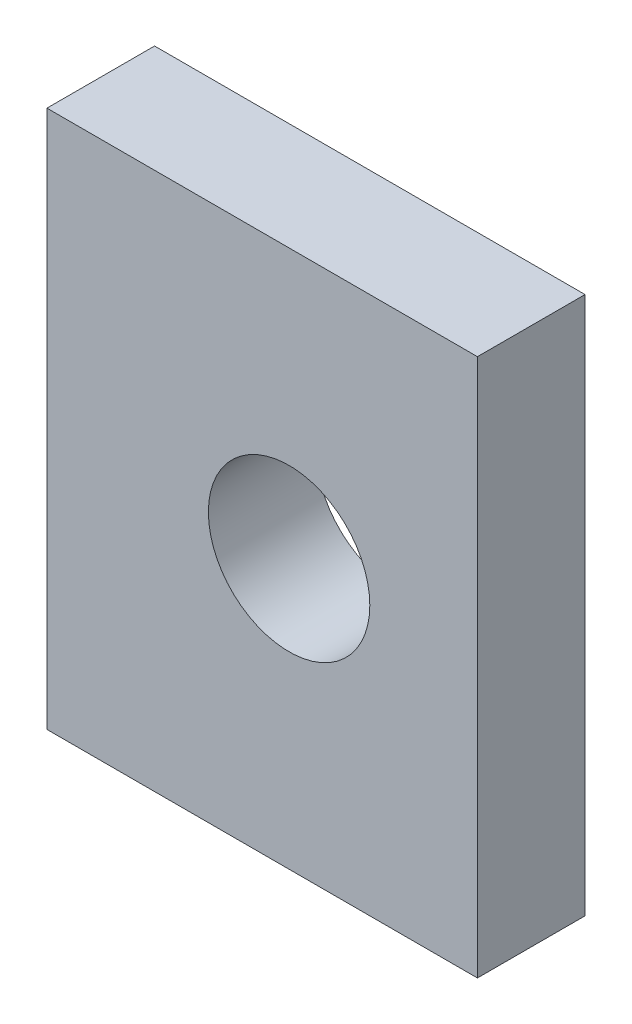
ISO-10303-21;
HEADER;
FILE_DESCRIPTION(('STEP AP214'),'2;1');
FILE_NAME('part.step','',(''),(''),'','','');
FILE_SCHEMA(('AUTOMOTIVE_DESIGN { 1 0 10303 214 1 1 1 1 }'));
ENDSEC;
DATA;
#1=APPLICATION_CONTEXT('core data for automotive mechanical design processes');
#2=APPLICATION_PROTOCOL_DEFINITION('international standard','automotive_design',2000,#1);
#3=PRODUCT_CONTEXT('',#1,'mechanical');
#4=PRODUCT('Part','Part','',(#3));
#5=PRODUCT_RELATED_PRODUCT_CATEGORY('part','',(#4));
#6=PRODUCT_DEFINITION_FORMATION('','',#4);
#7=PRODUCT_DEFINITION_CONTEXT('part definition',#1,'design');
#8=PRODUCT_DEFINITION('design','',#6,#7);
#9=PRODUCT_DEFINITION_SHAPE('','',#8);
#10=(LENGTH_UNIT() NAMED_UNIT(*) SI_UNIT(.MILLI.,.METRE.));
#11=(NAMED_UNIT(*) PLANE_ANGLE_UNIT() SI_UNIT($,.RADIAN.));
#12=(NAMED_UNIT(*) SI_UNIT($,.STERADIAN.) SOLID_ANGLE_UNIT());
#13=UNCERTAINTY_MEASURE_WITH_UNIT(LENGTH_MEASURE(1.E-05),#10,'distance_accuracy_value','');
#14=(GEOMETRIC_REPRESENTATION_CONTEXT(3) GLOBAL_UNCERTAINTY_ASSIGNED_CONTEXT((#13)) GLOBAL_UNIT_ASSIGNED_CONTEXT((#10,
#11,#12)) REPRESENTATION_CONTEXT('',''));
#15=CARTESIAN_POINT('',(0.,0.,0.));
#16=DIRECTION('',(0.,0.,1.));
#17=DIRECTION('',(1.,0.,0.));
#18=AXIS2_PLACEMENT_3D('',#15,#16,#17);
#19=CARTESIAN_POINT('',(0.,0.,2.));
#20=DIRECTION('',(0.,0.,-1.));
#21=DIRECTION('',(-1.,0.,0.));
#22=AXIS2_PLACEMENT_3D('',#19,#20,#21);
#23=PLANE('',#22);
#24=DIRECTION('',(0.,1.,0.));
#25=VECTOR('',#24,1.);
#26=CARTESIAN_POINT('',(7.99999999999996,10.,2.));
#27=LINE('',#26,#25);
#28=CARTESIAN_POINT('',(7.99999999999996,0.,2.));
#29=VERTEX_POINT('',#28);
#30=CARTESIAN_POINT('',(7.99999999999996,10.,2.));
#31=VERTEX_POINT('',#30);
#32=EDGE_CURVE('E85',#29,#31,#27,.T.);
#33=ORIENTED_EDGE('',*,*,#32,.T.);
#34=DIRECTION('',(-1.,0.,0.));
#35=VECTOR('',#34,1.);
#36=CARTESIAN_POINT('',(0.,10.,2.));
#37=LINE('',#36,#35);
#38=CARTESIAN_POINT('',(0.,10.,2.));
#39=VERTEX_POINT('',#38);
#40=EDGE_CURVE('E80',#31,#39,#37,.T.);
#41=ORIENTED_EDGE('',*,*,#40,.T.);
#42=DIRECTION('',(0.,-1.,0.));
#43=VECTOR('',#42,1.);
#44=CARTESIAN_POINT('',(0.,10.,2.));
#45=LINE('',#44,#43);
#46=CARTESIAN_POINT('',(0.,0.,2.));
#47=VERTEX_POINT('',#46);
#48=EDGE_CURVE('E83',#39,#47,#45,.T.);
#49=ORIENTED_EDGE('',*,*,#48,.T.);
#50=DIRECTION('',(1.,0.,0.));
#51=VECTOR('',#50,1.);
#52=CARTESIAN_POINT('',(7.99999999999996,0.,2.));
#53=LINE('',#52,#51);
#54=EDGE_CURVE('E50',#47,#29,#53,.T.);
#55=ORIENTED_EDGE('',*,*,#54,.T.);
#56=EDGE_LOOP('',(#33,#41,#49,#55));
#57=FACE_BOUND('',#56,.T.);
#58=CARTESIAN_POINT('',(4.49999999999998,5.,2.));
#59=DIRECTION('',(0.,0.,1.));
#60=DIRECTION('',(1.,0.,0.));
#61=AXIS2_PLACEMENT_3D('',#58,#59,#60);
#62=CIRCLE('',#61,1.5);
#63=CARTESIAN_POINT('',(5.99999999999998,5.,2.));
#64=VERTEX_POINT('',#63);
#65=EDGE_CURVE('E100',#64,#64,#62,.T.);
#66=ORIENTED_EDGE('',*,*,#65,.F.);
#67=EDGE_LOOP('',(#66));
#68=FACE_BOUND('',#67,.T.);
#69=ADVANCED_FACE('F33',(#57,#68),#23,.F.);
#70=CARTESIAN_POINT('',(0.,0.,0.));
#71=DIRECTION('',(0.,0.,-1.));
#72=DIRECTION('',(-1.,0.,0.));
#73=AXIS2_PLACEMENT_3D('',#70,#71,#72);
#74=PLANE('',#73);
#75=DIRECTION('',(0.,1.,0.));
#76=VECTOR('',#75,1.);
#77=CARTESIAN_POINT('',(7.99999999999996,10.,0.));
#78=LINE('',#77,#76);
#79=CARTESIAN_POINT('',(7.99999999999996,0.,0.));
#80=VERTEX_POINT('',#79);
#81=CARTESIAN_POINT('',(7.99999999999996,10.,0.));
#82=VERTEX_POINT('',#81);
#83=EDGE_CURVE('E97',#80,#82,#78,.T.);
#84=ORIENTED_EDGE('',*,*,#83,.F.);
#85=DIRECTION('',(1.,0.,0.));
#86=VECTOR('',#85,1.);
#87=CARTESIAN_POINT('',(7.99999999999996,0.,0.));
#88=LINE('',#87,#86);
#89=CARTESIAN_POINT('',(0.,0.,0.));
#90=VERTEX_POINT('',#89);
#91=EDGE_CURVE('E73',#90,#80,#88,.T.);
#92=ORIENTED_EDGE('',*,*,#91,.F.);
#93=DIRECTION('',(0.,-1.,0.));
#94=VECTOR('',#93,1.);
#95=CARTESIAN_POINT('',(0.,10.,0.));
#96=LINE('',#95,#94);
#97=CARTESIAN_POINT('',(0.,10.,0.));
#98=VERTEX_POINT('',#97);
#99=EDGE_CURVE('E67',#98,#90,#96,.T.);
#100=ORIENTED_EDGE('',*,*,#99,.F.);
#101=DIRECTION('',(-1.,0.,0.));
#102=VECTOR('',#101,1.);
#103=CARTESIAN_POINT('',(0.,10.,0.));
#104=LINE('',#103,#102);
#105=EDGE_CURVE('E89',#82,#98,#104,.T.);
#106=ORIENTED_EDGE('',*,*,#105,.F.);
#107=EDGE_LOOP('',(#84,#92,#100,#106));
#108=FACE_BOUND('',#107,.T.);
#109=CARTESIAN_POINT('',(4.49999999999998,5.,0.));
#110=DIRECTION('',(0.,0.,1.));
#111=DIRECTION('',(1.,0.,0.));
#112=AXIS2_PLACEMENT_3D('',#109,#110,#111);
#113=CIRCLE('',#112,1.5);
#114=CARTESIAN_POINT('',(5.99999999999998,5.,0.));
#115=VERTEX_POINT('',#114);
#116=EDGE_CURVE('E112',#115,#115,#113,.T.);
#117=ORIENTED_EDGE('',*,*,#116,.T.);
#118=EDGE_LOOP('',(#117));
#119=FACE_BOUND('',#118,.T.);
#120=ADVANCED_FACE('F108',(#108,#119),#74,.T.);
#121=CARTESIAN_POINT('',(7.99999999999996,10.,2.));
#122=DIRECTION('',(-1.,0.,0.));
#123=DIRECTION('',(0.,0.,1.));
#124=AXIS2_PLACEMENT_3D('',#121,#122,#123);
#125=PLANE('',#124);
#126=ORIENTED_EDGE('',*,*,#83,.T.);
#127=DIRECTION('',(0.,0.,-1.));
#128=VECTOR('',#127,1.);
#129=CARTESIAN_POINT('',(7.99999999999996,10.,2.));
#130=LINE('',#129,#128);
#131=EDGE_CURVE('E11',#31,#82,#130,.T.);
#132=ORIENTED_EDGE('',*,*,#131,.F.);
#133=ORIENTED_EDGE('',*,*,#32,.F.);
#134=DIRECTION('',(0.,0.,-1.));
#135=VECTOR('',#134,1.);
#136=CARTESIAN_POINT('',(7.99999999999996,0.,2.));
#137=LINE('',#136,#135);
#138=EDGE_CURVE('E93',#29,#80,#137,.T.);
#139=ORIENTED_EDGE('',*,*,#138,.T.);
#140=EDGE_LOOP('',(#126,#132,#133,#139));
#141=FACE_BOUND('',#140,.T.);
#142=ADVANCED_FACE('F35',(#141),#125,.F.);
#143=CARTESIAN_POINT('',(0.,10.,2.));
#144=DIRECTION('',(0.,-1.,0.));
#145=DIRECTION('',(1.,0.,0.));
#146=AXIS2_PLACEMENT_3D('',#143,#144,#145);
#147=PLANE('',#146);
#148=ORIENTED_EDGE('',*,*,#105,.T.);
#149=DIRECTION('',(0.,0.,-1.));
#150=VECTOR('',#149,1.);
#151=CARTESIAN_POINT('',(0.,10.,2.));
#152=LINE('',#151,#150);
#153=EDGE_CURVE('E42',#39,#98,#152,.T.);
#154=ORIENTED_EDGE('',*,*,#153,.F.);
#155=ORIENTED_EDGE('',*,*,#40,.F.);
#156=ORIENTED_EDGE('',*,*,#131,.T.);
#157=EDGE_LOOP('',(#148,#154,#155,#156));
#158=FACE_BOUND('',#157,.T.);
#159=ADVANCED_FACE('F88',(#158),#147,.F.);
#160=CARTESIAN_POINT('',(0.,10.,2.));
#161=DIRECTION('',(1.,0.,0.));
#162=DIRECTION('',(0.,1.,0.));
#163=AXIS2_PLACEMENT_3D('',#160,#161,#162);
#164=PLANE('',#163);
#165=ORIENTED_EDGE('',*,*,#99,.T.);
#166=DIRECTION('',(0.,0.,-1.));
#167=VECTOR('',#166,1.);
#168=CARTESIAN_POINT('',(0.,0.,2.));
#169=LINE('',#168,#167);
#170=EDGE_CURVE('E90',#47,#90,#169,.T.);
#171=ORIENTED_EDGE('',*,*,#170,.F.);
#172=ORIENTED_EDGE('',*,*,#48,.F.);
#173=ORIENTED_EDGE('',*,*,#153,.T.);
#174=EDGE_LOOP('',(#165,#171,#172,#173));
#175=FACE_BOUND('',#174,.T.);
#176=ADVANCED_FACE('F91',(#175),#164,.F.);
#177=CARTESIAN_POINT('',(7.99999999999996,0.,2.));
#178=DIRECTION('',(0.,1.,0.));
#179=DIRECTION('',(-1.,0.,0.));
#180=AXIS2_PLACEMENT_3D('',#177,#178,#179);
#181=PLANE('',#180);
#182=ORIENTED_EDGE('',*,*,#91,.T.);
#183=ORIENTED_EDGE('',*,*,#138,.F.);
#184=ORIENTED_EDGE('',*,*,#54,.F.);
#185=ORIENTED_EDGE('',*,*,#170,.T.);
#186=EDGE_LOOP('',(#182,#183,#184,#185));
#187=FACE_BOUND('',#186,.T.);
#188=ADVANCED_FACE('F105',(#187),#181,.F.);
#189=CARTESIAN_POINT('',(4.49999999999998,5.,2.));
#190=DIRECTION('',(0.,0.,-1.));
#191=DIRECTION('',(-1.,0.,0.));
#192=AXIS2_PLACEMENT_3D('',#189,#190,#191);
#193=CYLINDRICAL_SURFACE('',#192,1.5);
#194=ORIENTED_EDGE('',*,*,#65,.T.);
#195=EDGE_LOOP('',(#194));
#196=FACE_BOUND('',#195,.T.);
#197=ORIENTED_EDGE('',*,*,#116,.F.);
#198=EDGE_LOOP('',(#197));
#199=FACE_BOUND('',#198,.T.);
#200=ADVANCED_FACE('F118',(#196,#199),#193,.F.);
#201=CLOSED_SHELL('',(#69,#120,#142,#159,#176,#188,#200));
#202=MANIFOLD_SOLID_BREP('B2',#201);
#203=ADVANCED_BREP_SHAPE_REPRESENTATION('',(#18,#202),#14);
#204=SHAPE_DEFINITION_REPRESENTATION(#9,#203);
ENDSEC;
END-ISO-10303-21;
